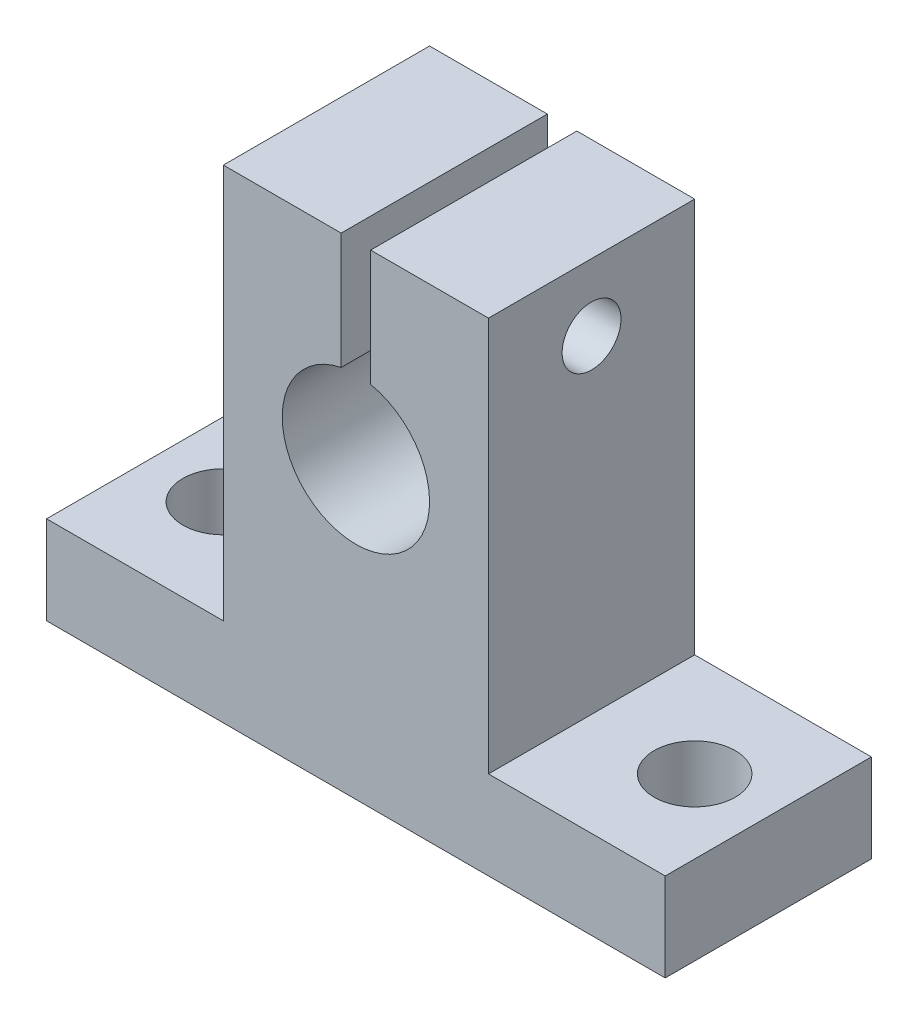
ISO-10303-21;
HEADER;
FILE_DESCRIPTION(('STEP AP214'),'2;1');
FILE_NAME('part.step','',(''),(''),'','','');
FILE_SCHEMA(('AUTOMOTIVE_DESIGN { 1 0 10303 214 1 1 1 1 }'));
ENDSEC;
DATA;
#1=APPLICATION_CONTEXT('core data for automotive mechanical design processes');
#2=APPLICATION_PROTOCOL_DEFINITION('international standard','automotive_design',2000,#1);
#3=PRODUCT_CONTEXT('',#1,'mechanical');
#4=PRODUCT('Part','Part','',(#3));
#5=PRODUCT_RELATED_PRODUCT_CATEGORY('part','',(#4));
#6=PRODUCT_DEFINITION_FORMATION('','',#4);
#7=PRODUCT_DEFINITION_CONTEXT('part definition',#1,'design');
#8=PRODUCT_DEFINITION('design','',#6,#7);
#9=PRODUCT_DEFINITION_SHAPE('','',#8);
#10=(LENGTH_UNIT() NAMED_UNIT(*) SI_UNIT(.MILLI.,.METRE.));
#11=(NAMED_UNIT(*) PLANE_ANGLE_UNIT() SI_UNIT($,.RADIAN.));
#12=(NAMED_UNIT(*) SI_UNIT($,.STERADIAN.) SOLID_ANGLE_UNIT());
#13=UNCERTAINTY_MEASURE_WITH_UNIT(LENGTH_MEASURE(1.E-05),#10,'distance_accuracy_value','');
#14=(GEOMETRIC_REPRESENTATION_CONTEXT(3) GLOBAL_UNCERTAINTY_ASSIGNED_CONTEXT((#13)) GLOBAL_UNIT_ASSIGNED_CONTEXT((#10,
#11,#12)) REPRESENTATION_CONTEXT('',''));
#15=CARTESIAN_POINT('',(0.,0.,0.));
#16=DIRECTION('',(0.,0.,1.));
#17=DIRECTION('',(1.,0.,0.));
#18=AXIS2_PLACEMENT_3D('',#15,#16,#17);
#19=CARTESIAN_POINT('',(42.,28.2542340549186,7.));
#20=DIRECTION('',(-1.,0.,0.));
#21=DIRECTION('',(0.,0.,1.));
#22=AXIS2_PLACEMENT_3D('',#19,#20,#21);
#23=CYLINDRICAL_SURFACE('',#22,2.);
#24=CARTESIAN_POINT('',(20.,28.2542340549186,7.));
#25=DIRECTION('',(-1.,0.,0.));
#26=DIRECTION('',(0.,0.,1.));
#27=AXIS2_PLACEMENT_3D('',#24,#25,#26);
#28=CIRCLE('',#27,2.);
#29=CARTESIAN_POINT('',(20.,28.2542340549186,9.));
#30=VERTEX_POINT('',#29);
#31=EDGE_CURVE('E298',#30,#30,#28,.T.);
#32=ORIENTED_EDGE('',*,*,#31,.F.);
#33=EDGE_LOOP('',(#32));
#34=FACE_BOUND('',#33,.T.);
#35=CARTESIAN_POINT('',(15.,28.2542340549186,7.));
#36=DIRECTION('',(-1.,0.,0.));
#37=DIRECTION('',(0.,0.,1.));
#38=AXIS2_PLACEMENT_3D('',#35,#36,#37);
#39=CIRCLE('',#38,2.);
#40=CARTESIAN_POINT('',(15.,28.2542340549186,9.));
#41=VERTEX_POINT('',#40);
#42=EDGE_CURVE('E38',#41,#41,#39,.F.);
#43=ORIENTED_EDGE('',*,*,#42,.F.);
#44=EDGE_LOOP('',(#43));
#45=FACE_BOUND('',#44,.T.);
#46=ADVANCED_FACE('F34',(#34,#45),#23,.F.);
#47=CARTESIAN_POINT('',(0.,0.,14.));
#48=DIRECTION('',(1.,0.,0.));
#49=DIRECTION('',(0.,0.,-1.));
#50=AXIS2_PLACEMENT_3D('',#47,#48,#49);
#51=PLANE('',#50);
#52=DIRECTION('',(0.,-1.,0.));
#53=VECTOR('',#52,1.);
#54=CARTESIAN_POINT('',(0.,0.,0.));
#55=LINE('',#54,#53);
#56=CARTESIAN_POINT('',(0.,6.,0.));
#57=VERTEX_POINT('',#56);
#58=CARTESIAN_POINT('',(0.,0.,0.));
#59=VERTEX_POINT('',#58);
#60=EDGE_CURVE('E156',#57,#59,#55,.T.);
#61=ORIENTED_EDGE('',*,*,#60,.T.);
#62=DIRECTION('',(0.,0.,-1.));
#63=VECTOR('',#62,1.);
#64=CARTESIAN_POINT('',(0.,0.,14.));
#65=LINE('',#64,#63);
#66=CARTESIAN_POINT('',(0.,0.,14.));
#67=VERTEX_POINT('',#66);
#68=EDGE_CURVE('E11',#67,#59,#65,.T.);
#69=ORIENTED_EDGE('',*,*,#68,.F.);
#70=DIRECTION('',(0.,-1.,0.));
#71=VECTOR('',#70,1.);
#72=CARTESIAN_POINT('',(0.,0.,14.));
#73=LINE('',#72,#71);
#74=CARTESIAN_POINT('',(0.,6.,14.));
#75=VERTEX_POINT('',#74);
#76=EDGE_CURVE('E179',#75,#67,#73,.T.);
#77=ORIENTED_EDGE('',*,*,#76,.F.);
#78=DIRECTION('',(0.,0.,-1.));
#79=VECTOR('',#78,1.);
#80=CARTESIAN_POINT('',(0.,6.,14.));
#81=LINE('',#80,#79);
#82=EDGE_CURVE('E152',#75,#57,#81,.T.);
#83=ORIENTED_EDGE('',*,*,#82,.T.);
#84=EDGE_LOOP('',(#61,#69,#77,#83));
#85=FACE_BOUND('',#84,.T.);
#86=ADVANCED_FACE('F36',(#85),#51,.F.);
#87=CARTESIAN_POINT('',(0.,0.,14.));
#88=DIRECTION('',(0.,1.,0.));
#89=DIRECTION('',(0.,0.,1.));
#90=AXIS2_PLACEMENT_3D('',#87,#88,#89);
#91=PLANE('',#90);
#92=CARTESIAN_POINT('',(37.,0.,7.));
#93=DIRECTION('',(0.,1.,0.));
#94=DIRECTION('',(1.,0.,0.));
#95=AXIS2_PLACEMENT_3D('',#92,#93,#94);
#96=CIRCLE('',#95,2.74999999999999);
#97=CARTESIAN_POINT('',(39.75,0.,7.));
#98=VERTEX_POINT('',#97);
#99=EDGE_CURVE('E296',#98,#98,#96,.T.);
#100=ORIENTED_EDGE('',*,*,#99,.T.);
#101=EDGE_LOOP('',(#100));
#102=FACE_BOUND('',#101,.T.);
#103=CARTESIAN_POINT('',(5.,0.,7.));
#104=DIRECTION('',(0.,1.,0.));
#105=DIRECTION('',(-1.,0.,0.));
#106=AXIS2_PLACEMENT_3D('',#103,#104,#105);
#107=CIRCLE('',#106,2.75);
#108=CARTESIAN_POINT('',(2.25,0.,7.));
#109=VERTEX_POINT('',#108);
#110=EDGE_CURVE('E160',#109,#109,#107,.T.);
#111=ORIENTED_EDGE('',*,*,#110,.T.);
#112=EDGE_LOOP('',(#111));
#113=FACE_BOUND('',#112,.T.);
#114=DIRECTION('',(1.,0.,0.));
#115=VECTOR('',#114,1.);
#116=CARTESIAN_POINT('',(0.,0.,0.));
#117=LINE('',#116,#115);
#118=CARTESIAN_POINT('',(42.,0.,0.));
#119=VERTEX_POINT('',#118);
#120=EDGE_CURVE('E159',#59,#119,#117,.T.);
#121=ORIENTED_EDGE('',*,*,#120,.T.);
#122=DIRECTION('',(0.,0.,-1.));
#123=VECTOR('',#122,1.);
#124=CARTESIAN_POINT('',(42.,0.,14.));
#125=LINE('',#124,#123);
#126=CARTESIAN_POINT('',(42.,0.,14.));
#127=VERTEX_POINT('',#126);
#128=EDGE_CURVE('E44',#127,#119,#125,.T.);
#129=ORIENTED_EDGE('',*,*,#128,.F.);
#130=DIRECTION('',(1.,0.,0.));
#131=VECTOR('',#130,1.);
#132=CARTESIAN_POINT('',(0.,0.,14.));
#133=LINE('',#132,#131);
#134=EDGE_CURVE('E107',#67,#127,#133,.T.);
#135=ORIENTED_EDGE('',*,*,#134,.F.);
#136=ORIENTED_EDGE('',*,*,#68,.T.);
#137=EDGE_LOOP('',(#121,#129,#135,#136));
#138=FACE_BOUND('',#137,.T.);
#139=ADVANCED_FACE('F267',(#102,#113,#138),#91,.F.);
#140=CARTESIAN_POINT('',(42.,0.,14.));
#141=DIRECTION('',(-1.,0.,0.));
#142=DIRECTION('',(0.,0.,1.));
#143=AXIS2_PLACEMENT_3D('',#140,#141,#142);
#144=PLANE('',#143);
#145=DIRECTION('',(0.,1.,0.));
#146=VECTOR('',#145,1.);
#147=CARTESIAN_POINT('',(42.,0.,0.));
#148=LINE('',#147,#146);
#149=CARTESIAN_POINT('',(42.,6.,0.));
#150=VERTEX_POINT('',#149);
#151=EDGE_CURVE('E162',#119,#150,#148,.T.);
#152=ORIENTED_EDGE('',*,*,#151,.T.);
#153=DIRECTION('',(0.,0.,-1.));
#154=VECTOR('',#153,1.);
#155=CARTESIAN_POINT('',(42.,6.,14.));
#156=LINE('',#155,#154);
#157=CARTESIAN_POINT('',(42.,6.,14.));
#158=VERTEX_POINT('',#157);
#159=EDGE_CURVE('E198',#158,#150,#156,.T.);
#160=ORIENTED_EDGE('',*,*,#159,.F.);
#161=DIRECTION('',(0.,1.,0.));
#162=VECTOR('',#161,1.);
#163=CARTESIAN_POINT('',(42.,0.,14.));
#164=LINE('',#163,#162);
#165=EDGE_CURVE('E207',#127,#158,#164,.T.);
#166=ORIENTED_EDGE('',*,*,#165,.F.);
#167=ORIENTED_EDGE('',*,*,#128,.T.);
#168=EDGE_LOOP('',(#152,#160,#166,#167));
#169=FACE_BOUND('',#168,.T.);
#170=ADVANCED_FACE('F205',(#169),#144,.F.);
#171=CARTESIAN_POINT('',(42.,6.,14.));
#172=DIRECTION('',(0.,-1.,0.));
#173=DIRECTION('',(1.,0.,0.));
#174=AXIS2_PLACEMENT_3D('',#171,#172,#173);
#175=PLANE('',#174);
#176=CARTESIAN_POINT('',(37.,5.99999999999999,7.));
#177=DIRECTION('',(0.,1.,0.));
#178=DIRECTION('',(1.,0.,0.));
#179=AXIS2_PLACEMENT_3D('',#176,#177,#178);
#180=CIRCLE('',#179,2.74999999999999);
#181=CARTESIAN_POINT('',(39.75,5.99999999999999,7.));
#182=VERTEX_POINT('',#181);
#183=EDGE_CURVE('E293',#182,#182,#180,.T.);
#184=ORIENTED_EDGE('',*,*,#183,.F.);
#185=EDGE_LOOP('',(#184));
#186=FACE_BOUND('',#185,.T.);
#187=DIRECTION('',(-1.,0.,0.));
#188=VECTOR('',#187,1.);
#189=CARTESIAN_POINT('',(42.,6.,0.));
#190=LINE('',#189,#188);
#191=CARTESIAN_POINT('',(30.,6.,0.));
#192=VERTEX_POINT('',#191);
#193=EDGE_CURVE('E164',#150,#192,#190,.T.);
#194=ORIENTED_EDGE('',*,*,#193,.T.);
#195=DIRECTION('',(0.,0.,-1.));
#196=VECTOR('',#195,1.);
#197=CARTESIAN_POINT('',(30.,6.,14.));
#198=LINE('',#197,#196);
#199=CARTESIAN_POINT('',(30.,6.,14.));
#200=VERTEX_POINT('',#199);
#201=EDGE_CURVE('E195',#200,#192,#198,.T.);
#202=ORIENTED_EDGE('',*,*,#201,.F.);
#203=DIRECTION('',(-1.,0.,0.));
#204=VECTOR('',#203,1.);
#205=CARTESIAN_POINT('',(42.,6.,14.));
#206=LINE('',#205,#204);
#207=EDGE_CURVE('E225',#158,#200,#206,.T.);
#208=ORIENTED_EDGE('',*,*,#207,.F.);
#209=ORIENTED_EDGE('',*,*,#159,.T.);
#210=EDGE_LOOP('',(#194,#202,#208,#209));
#211=FACE_BOUND('',#210,.T.);
#212=ADVANCED_FACE('F216',(#186,#211),#175,.F.);
#213=CARTESIAN_POINT('',(30.,6.,14.));
#214=DIRECTION('',(-1.,0.,0.));
#215=DIRECTION('',(0.,0.,1.));
#216=AXIS2_PLACEMENT_3D('',#213,#214,#215);
#217=PLANE('',#216);
#218=CARTESIAN_POINT('',(30.,28.2542340549186,7.));
#219=DIRECTION('',(-1.,0.,0.));
#220=DIRECTION('',(0.,0.,1.));
#221=AXIS2_PLACEMENT_3D('',#218,#219,#220);
#222=CIRCLE('',#221,2.);
#223=CARTESIAN_POINT('',(30.,28.2542340549186,9.));
#224=VERTEX_POINT('',#223);
#225=EDGE_CURVE('E291',#224,#224,#222,.T.);
#226=ORIENTED_EDGE('',*,*,#225,.T.);
#227=EDGE_LOOP('',(#226));
#228=FACE_BOUND('',#227,.T.);
#229=DIRECTION('',(0.,1.,0.));
#230=VECTOR('',#229,1.);
#231=CARTESIAN_POINT('',(30.,6.,0.));
#232=LINE('',#231,#230);
#233=CARTESIAN_POINT('',(30.,32.8,0.));
#234=VERTEX_POINT('',#233);
#235=EDGE_CURVE('E166',#192,#234,#232,.T.);
#236=ORIENTED_EDGE('',*,*,#235,.T.);
#237=DIRECTION('',(0.,0.,-1.));
#238=VECTOR('',#237,1.);
#239=CARTESIAN_POINT('',(30.,32.8,14.));
#240=LINE('',#239,#238);
#241=CARTESIAN_POINT('',(30.,32.8,14.));
#242=VERTEX_POINT('',#241);
#243=EDGE_CURVE('E192',#242,#234,#240,.T.);
#244=ORIENTED_EDGE('',*,*,#243,.F.);
#245=DIRECTION('',(0.,1.,0.));
#246=VECTOR('',#245,1.);
#247=CARTESIAN_POINT('',(30.,6.,14.));
#248=LINE('',#247,#246);
#249=EDGE_CURVE('E222',#200,#242,#248,.T.);
#250=ORIENTED_EDGE('',*,*,#249,.F.);
#251=ORIENTED_EDGE('',*,*,#201,.T.);
#252=EDGE_LOOP('',(#236,#244,#250,#251));
#253=FACE_BOUND('',#252,.T.);
#254=ADVANCED_FACE('F220',(#228,#253),#217,.F.);
#255=CARTESIAN_POINT('',(30.,32.8,14.));
#256=DIRECTION('',(0.,-1.,0.));
#257=DIRECTION('',(0.,0.,-1.));
#258=AXIS2_PLACEMENT_3D('',#255,#256,#257);
#259=PLANE('',#258);
#260=DIRECTION('',(-1.,0.,0.));
#261=VECTOR('',#260,1.);
#262=CARTESIAN_POINT('',(30.,32.8,0.));
#263=LINE('',#262,#261);
#264=CARTESIAN_POINT('',(22.,32.8,0.));
#265=VERTEX_POINT('',#264);
#266=EDGE_CURVE('E168',#234,#265,#263,.T.);
#267=ORIENTED_EDGE('',*,*,#266,.T.);
#268=DIRECTION('',(0.,0.,-1.));
#269=VECTOR('',#268,1.);
#270=CARTESIAN_POINT('',(22.,32.8,14.));
#271=LINE('',#270,#269);
#272=CARTESIAN_POINT('',(22.,32.8,14.));
#273=VERTEX_POINT('',#272);
#274=EDGE_CURVE('E189',#273,#265,#271,.T.);
#275=ORIENTED_EDGE('',*,*,#274,.F.);
#276=DIRECTION('',(-1.,0.,0.));
#277=VECTOR('',#276,1.);
#278=CARTESIAN_POINT('',(30.,32.8,14.));
#279=LINE('',#278,#277);
#280=EDGE_CURVE('E224',#242,#273,#279,.T.);
#281=ORIENTED_EDGE('',*,*,#280,.F.);
#282=ORIENTED_EDGE('',*,*,#243,.T.);
#283=EDGE_LOOP('',(#267,#275,#281,#282));
#284=FACE_BOUND('',#283,.T.);
#285=ADVANCED_FACE('F331',(#284),#259,.F.);
#286=CARTESIAN_POINT('',(22.,32.8,14.));
#287=DIRECTION('',(1.,0.,0.));
#288=DIRECTION('',(0.,0.,-1.));
#289=AXIS2_PLACEMENT_3D('',#286,#287,#288);
#290=PLANE('',#289);
#291=CARTESIAN_POINT('',(22.,28.2542340549186,7.));
#292=DIRECTION('',(1.,0.,0.));
#293=DIRECTION('',(0.,0.,-1.));
#294=AXIS2_PLACEMENT_3D('',#291,#292,#293);
#295=CIRCLE('',#294,2.);
#296=CARTESIAN_POINT('',(22.,28.2542340549186,5.));
#297=VERTEX_POINT('',#296);
#298=EDGE_CURVE('E288',#297,#297,#295,.T.);
#299=ORIENTED_EDGE('',*,*,#298,.T.);
#300=EDGE_LOOP('',(#299));
#301=FACE_BOUND('',#300,.T.);
#302=DIRECTION('',(0.,-1.,0.));
#303=VECTOR('',#302,1.);
#304=CARTESIAN_POINT('',(22.,32.8,0.));
#305=LINE('',#304,#303);
#306=CARTESIAN_POINT('',(22.,24.8989794855664,0.));
#307=VERTEX_POINT('',#306);
#308=EDGE_CURVE('E170',#265,#307,#305,.T.);
#309=ORIENTED_EDGE('',*,*,#308,.T.);
#310=DIRECTION('',(0.,0.,-1.));
#311=VECTOR('',#310,1.);
#312=CARTESIAN_POINT('',(22.,24.8989794855664,14.));
#313=LINE('',#312,#311);
#314=CARTESIAN_POINT('',(22.,24.8989794855664,14.));
#315=VERTEX_POINT('',#314);
#316=EDGE_CURVE('E186',#315,#307,#313,.T.);
#317=ORIENTED_EDGE('',*,*,#316,.F.);
#318=DIRECTION('',(0.,-1.,0.));
#319=VECTOR('',#318,1.);
#320=CARTESIAN_POINT('',(22.,32.8,14.));
#321=LINE('',#320,#319);
#322=EDGE_CURVE('E227',#273,#315,#321,.T.);
#323=ORIENTED_EDGE('',*,*,#322,.F.);
#324=ORIENTED_EDGE('',*,*,#274,.T.);
#325=EDGE_LOOP('',(#309,#317,#323,#324));
#326=FACE_BOUND('',#325,.T.);
#327=ADVANCED_FACE('F334',(#301,#326),#290,.F.);
#328=CARTESIAN_POINT('',(21.,20.,14.));
#329=DIRECTION('',(0.,0.,-1.));
#330=DIRECTION('',(-1.,0.,0.));
#331=AXIS2_PLACEMENT_3D('',#328,#329,#330);
#332=CYLINDRICAL_SURFACE('',#331,5.);
#333=CARTESIAN_POINT('',(21.,20.,0.));
#334=DIRECTION('',(0.,0.,-1.));
#335=DIRECTION('',(1.,0.,0.));
#336=AXIS2_PLACEMENT_3D('',#333,#334,#335);
#337=CIRCLE('',#336,5.);
#338=CARTESIAN_POINT('',(20.,24.8989794855664,0.));
#339=VERTEX_POINT('',#338);
#340=EDGE_CURVE('E172',#307,#339,#337,.T.);
#341=ORIENTED_EDGE('',*,*,#340,.T.);
#342=DIRECTION('',(0.,0.,-1.));
#343=VECTOR('',#342,1.);
#344=CARTESIAN_POINT('',(20.,24.8989794855664,14.));
#345=LINE('',#344,#343);
#346=CARTESIAN_POINT('',(20.,24.8989794855664,14.));
#347=VERTEX_POINT('',#346);
#348=EDGE_CURVE('E183',#347,#339,#345,.T.);
#349=ORIENTED_EDGE('',*,*,#348,.F.);
#350=CARTESIAN_POINT('',(21.,20.,14.));
#351=DIRECTION('',(0.,0.,-1.));
#352=DIRECTION('',(1.,0.,0.));
#353=AXIS2_PLACEMENT_3D('',#350,#351,#352);
#354=CIRCLE('',#353,5.);
#355=EDGE_CURVE('E233',#315,#347,#354,.T.);
#356=ORIENTED_EDGE('',*,*,#355,.F.);
#357=ORIENTED_EDGE('',*,*,#316,.T.);
#358=EDGE_LOOP('',(#341,#349,#356,#357));
#359=FACE_BOUND('',#358,.T.);
#360=ADVANCED_FACE('F239',(#359),#332,.F.);
#361=CARTESIAN_POINT('',(20.,32.8,14.));
#362=DIRECTION('',(-1.,0.,0.));
#363=DIRECTION('',(0.,0.,1.));
#364=AXIS2_PLACEMENT_3D('',#361,#362,#363);
#365=PLANE('',#364);
#366=ORIENTED_EDGE('',*,*,#31,.T.);
#367=EDGE_LOOP('',(#366));
#368=FACE_BOUND('',#367,.T.);
#369=DIRECTION('',(0.,1.,0.));
#370=VECTOR('',#369,1.);
#371=CARTESIAN_POINT('',(20.,32.8,0.));
#372=LINE('',#371,#370);
#373=CARTESIAN_POINT('',(20.,32.8,0.));
#374=VERTEX_POINT('',#373);
#375=EDGE_CURVE('E174',#339,#374,#372,.T.);
#376=ORIENTED_EDGE('',*,*,#375,.T.);
#377=DIRECTION('',(0.,0.,-1.));
#378=VECTOR('',#377,1.);
#379=CARTESIAN_POINT('',(20.,32.8,14.));
#380=LINE('',#379,#378);
#381=CARTESIAN_POINT('',(20.,32.8,14.));
#382=VERTEX_POINT('',#381);
#383=EDGE_CURVE('E147',#382,#374,#380,.T.);
#384=ORIENTED_EDGE('',*,*,#383,.F.);
#385=DIRECTION('',(0.,1.,0.));
#386=VECTOR('',#385,1.);
#387=CARTESIAN_POINT('',(20.,32.8,14.));
#388=LINE('',#387,#386);
#389=EDGE_CURVE('E138',#347,#382,#388,.T.);
#390=ORIENTED_EDGE('',*,*,#389,.F.);
#391=ORIENTED_EDGE('',*,*,#348,.T.);
#392=EDGE_LOOP('',(#376,#384,#390,#391));
#393=FACE_BOUND('',#392,.T.);
#394=ADVANCED_FACE('F243',(#368,#393),#365,.F.);
#395=CARTESIAN_POINT('',(12.,32.8,14.));
#396=DIRECTION('',(0.,-1.,0.));
#397=DIRECTION('',(0.,0.,-1.));
#398=AXIS2_PLACEMENT_3D('',#395,#396,#397);
#399=PLANE('',#398);
#400=DIRECTION('',(-1.,0.,0.));
#401=VECTOR('',#400,1.);
#402=CARTESIAN_POINT('',(12.,32.8,0.));
#403=LINE('',#402,#401);
#404=CARTESIAN_POINT('',(12.,32.8,0.));
#405=VERTEX_POINT('',#404);
#406=EDGE_CURVE('E146',#374,#405,#403,.T.);
#407=ORIENTED_EDGE('',*,*,#406,.T.);
#408=DIRECTION('',(0.,0.,-1.));
#409=VECTOR('',#408,1.);
#410=CARTESIAN_POINT('',(12.,32.8,14.));
#411=LINE('',#410,#409);
#412=CARTESIAN_POINT('',(12.,32.8,14.));
#413=VERTEX_POINT('',#412);
#414=EDGE_CURVE('E143',#413,#405,#411,.T.);
#415=ORIENTED_EDGE('',*,*,#414,.F.);
#416=DIRECTION('',(-1.,0.,0.));
#417=VECTOR('',#416,1.);
#418=CARTESIAN_POINT('',(12.,32.8,14.));
#419=LINE('',#418,#417);
#420=EDGE_CURVE('E132',#382,#413,#419,.T.);
#421=ORIENTED_EDGE('',*,*,#420,.F.);
#422=ORIENTED_EDGE('',*,*,#383,.T.);
#423=EDGE_LOOP('',(#407,#415,#421,#422));
#424=FACE_BOUND('',#423,.T.);
#425=ADVANCED_FACE('F144',(#424),#399,.F.);
#426=CARTESIAN_POINT('',(12.,6.,14.));
#427=DIRECTION('',(1.,0.,0.));
#428=DIRECTION('',(0.,0.,-1.));
#429=AXIS2_PLACEMENT_3D('',#426,#427,#428);
#430=PLANE('',#429);
#431=CARTESIAN_POINT('',(12.,28.2542340549186,7.));
#432=DIRECTION('',(-1.,0.,0.));
#433=DIRECTION('',(0.,0.,1.));
#434=AXIS2_PLACEMENT_3D('',#431,#432,#433);
#435=CIRCLE('',#434,3.5);
#436=CARTESIAN_POINT('',(12.,28.2542340549186,10.5));
#437=VERTEX_POINT('',#436);
#438=EDGE_CURVE('E382',#437,#437,#435,.T.);
#439=ORIENTED_EDGE('',*,*,#438,.F.);
#440=EDGE_LOOP('',(#439));
#441=FACE_BOUND('',#440,.T.);
#442=DIRECTION('',(0.,-1.,0.));
#443=VECTOR('',#442,1.);
#444=CARTESIAN_POINT('',(12.,6.,0.));
#445=LINE('',#444,#443);
#446=CARTESIAN_POINT('',(12.,6.,0.));
#447=VERTEX_POINT('',#446);
#448=EDGE_CURVE('E93',#405,#447,#445,.T.);
#449=ORIENTED_EDGE('',*,*,#448,.T.);
#450=DIRECTION('',(0.,0.,-1.));
#451=VECTOR('',#450,1.);
#452=CARTESIAN_POINT('',(12.,6.,14.));
#453=LINE('',#452,#451);
#454=CARTESIAN_POINT('',(12.,6.,14.));
#455=VERTEX_POINT('',#454);
#456=EDGE_CURVE('E148',#455,#447,#453,.T.);
#457=ORIENTED_EDGE('',*,*,#456,.F.);
#458=DIRECTION('',(0.,-1.,0.));
#459=VECTOR('',#458,1.);
#460=CARTESIAN_POINT('',(12.,6.,14.));
#461=LINE('',#460,#459);
#462=EDGE_CURVE('E136',#413,#455,#461,.T.);
#463=ORIENTED_EDGE('',*,*,#462,.F.);
#464=ORIENTED_EDGE('',*,*,#414,.T.);
#465=EDGE_LOOP('',(#449,#457,#463,#464));
#466=FACE_BOUND('',#465,.T.);
#467=ADVANCED_FACE('F150',(#441,#466),#430,.F.);
#468=CARTESIAN_POINT('',(0.,6.,14.));
#469=DIRECTION('',(0.,-1.,0.));
#470=DIRECTION('',(1.,0.,0.));
#471=AXIS2_PLACEMENT_3D('',#468,#469,#470);
#472=PLANE('',#471);
#473=CARTESIAN_POINT('',(5.,6.,7.));
#474=DIRECTION('',(0.,1.,0.));
#475=DIRECTION('',(-1.,0.,0.));
#476=AXIS2_PLACEMENT_3D('',#473,#474,#475);
#477=CIRCLE('',#476,2.75);
#478=CARTESIAN_POINT('',(2.25,6.,7.));
#479=VERTEX_POINT('',#478);
#480=EDGE_CURVE('E303',#479,#479,#477,.T.);
#481=ORIENTED_EDGE('',*,*,#480,.F.);
#482=EDGE_LOOP('',(#481));
#483=FACE_BOUND('',#482,.T.);
#484=DIRECTION('',(-1.,0.,0.));
#485=VECTOR('',#484,1.);
#486=CARTESIAN_POINT('',(0.,6.,0.));
#487=LINE('',#486,#485);
#488=EDGE_CURVE('E99',#447,#57,#487,.T.);
#489=ORIENTED_EDGE('',*,*,#488,.T.);
#490=ORIENTED_EDGE('',*,*,#82,.F.);
#491=DIRECTION('',(-1.,0.,0.));
#492=VECTOR('',#491,1.);
#493=CARTESIAN_POINT('',(0.,6.,14.));
#494=LINE('',#493,#492);
#495=EDGE_CURVE('E52',#455,#75,#494,.T.);
#496=ORIENTED_EDGE('',*,*,#495,.F.);
#497=ORIENTED_EDGE('',*,*,#456,.T.);
#498=EDGE_LOOP('',(#489,#490,#496,#497));
#499=FACE_BOUND('',#498,.T.);
#500=ADVANCED_FACE('F247',(#483,#499),#472,.F.);
#501=CARTESIAN_POINT('',(21.,20.,14.));
#502=DIRECTION('',(0.,0.,1.));
#503=DIRECTION('',(1.,0.,0.));
#504=AXIS2_PLACEMENT_3D('',#501,#502,#503);
#505=PLANE('',#504);
#506=ORIENTED_EDGE('',*,*,#76,.T.);
#507=ORIENTED_EDGE('',*,*,#134,.T.);
#508=ORIENTED_EDGE('',*,*,#165,.T.);
#509=ORIENTED_EDGE('',*,*,#207,.T.);
#510=ORIENTED_EDGE('',*,*,#249,.T.);
#511=ORIENTED_EDGE('',*,*,#280,.T.);
#512=ORIENTED_EDGE('',*,*,#322,.T.);
#513=ORIENTED_EDGE('',*,*,#355,.T.);
#514=ORIENTED_EDGE('',*,*,#389,.T.);
#515=ORIENTED_EDGE('',*,*,#420,.T.);
#516=ORIENTED_EDGE('',*,*,#462,.T.);
#517=ORIENTED_EDGE('',*,*,#495,.T.);
#518=EDGE_LOOP('',(#506,#507,#508,#509,#510,#511,#512,#513,#514,#515,#516,#517));
#519=FACE_BOUND('',#518,.T.);
#520=ADVANCED_FACE('F134',(#519),#505,.T.);
#521=CARTESIAN_POINT('',(21.,20.,0.));
#522=DIRECTION('',(0.,0.,1.));
#523=DIRECTION('',(1.,0.,0.));
#524=AXIS2_PLACEMENT_3D('',#521,#522,#523);
#525=PLANE('',#524);
#526=ORIENTED_EDGE('',*,*,#60,.F.);
#527=ORIENTED_EDGE('',*,*,#488,.F.);
#528=ORIENTED_EDGE('',*,*,#448,.F.);
#529=ORIENTED_EDGE('',*,*,#406,.F.);
#530=ORIENTED_EDGE('',*,*,#375,.F.);
#531=ORIENTED_EDGE('',*,*,#340,.F.);
#532=ORIENTED_EDGE('',*,*,#308,.F.);
#533=ORIENTED_EDGE('',*,*,#266,.F.);
#534=ORIENTED_EDGE('',*,*,#235,.F.);
#535=ORIENTED_EDGE('',*,*,#193,.F.);
#536=ORIENTED_EDGE('',*,*,#151,.F.);
#537=ORIENTED_EDGE('',*,*,#120,.F.);
#538=EDGE_LOOP('',(#526,#527,#528,#529,#530,#531,#532,#533,#534,#535,#536,#537));
#539=FACE_BOUND('',#538,.T.);
#540=ADVANCED_FACE('F211',(#539),#525,.F.);
#541=CARTESIAN_POINT('',(5.,0.,7.));
#542=DIRECTION('',(0.,1.,0.));
#543=DIRECTION('',(-1.,0.,0.));
#544=AXIS2_PLACEMENT_3D('',#541,#542,#543);
#545=CYLINDRICAL_SURFACE('',#544,2.75);
#546=ORIENTED_EDGE('',*,*,#110,.F.);
#547=EDGE_LOOP('',(#546));
#548=FACE_BOUND('',#547,.T.);
#549=ORIENTED_EDGE('',*,*,#480,.T.);
#550=EDGE_LOOP('',(#549));
#551=FACE_BOUND('',#550,.T.);
#552=ADVANCED_FACE('F283',(#548,#551),#545,.F.);
#553=CARTESIAN_POINT('',(37.,0.,7.));
#554=DIRECTION('',(0.,1.,0.));
#555=DIRECTION('',(-1.,0.,0.));
#556=AXIS2_PLACEMENT_3D('',#553,#554,#555);
#557=CYLINDRICAL_SURFACE('',#556,2.74999999999999);
#558=ORIENTED_EDGE('',*,*,#99,.F.);
#559=EDGE_LOOP('',(#558));
#560=FACE_BOUND('',#559,.T.);
#561=ORIENTED_EDGE('',*,*,#183,.T.);
#562=EDGE_LOOP('',(#561));
#563=FACE_BOUND('',#562,.T.);
#564=ADVANCED_FACE('F274',(#560,#563),#557,.F.);
#565=ORIENTED_EDGE('',*,*,#298,.F.);
#566=EDGE_LOOP('',(#565));
#567=FACE_BOUND('',#566,.T.);
#568=ORIENTED_EDGE('',*,*,#225,.F.);
#569=EDGE_LOOP('',(#568));
#570=FACE_BOUND('',#569,.T.);
#571=ADVANCED_FACE('F263',(#567,#570),#23,.F.);
#572=CARTESIAN_POINT('',(15.,28.2542340549186,7.));
#573=DIRECTION('',(-1.,0.,0.));
#574=DIRECTION('',(0.,0.,1.));
#575=AXIS2_PLACEMENT_3D('',#572,#573,#574);
#576=PLANE('',#575);
#577=CARTESIAN_POINT('',(15.,28.2542340549186,7.));
#578=DIRECTION('',(-1.,0.,0.));
#579=DIRECTION('',(0.,0.,1.));
#580=AXIS2_PLACEMENT_3D('',#577,#578,#579);
#581=CIRCLE('',#580,3.5);
#582=CARTESIAN_POINT('',(15.,28.2542340549186,10.5));
#583=VERTEX_POINT('',#582);
#584=EDGE_CURVE('E379',#583,#583,#581,.T.);
#585=ORIENTED_EDGE('',*,*,#584,.T.);
#586=EDGE_LOOP('',(#585));
#587=FACE_BOUND('',#586,.T.);
#588=ORIENTED_EDGE('',*,*,#42,.T.);
#589=EDGE_LOOP('',(#588));
#590=FACE_BOUND('',#589,.T.);
#591=ADVANCED_FACE('F273',(#587,#590),#576,.T.);
#592=CARTESIAN_POINT('',(15.,28.2542340549186,7.));
#593=DIRECTION('',(-1.,0.,0.));
#594=DIRECTION('',(0.,0.,1.));
#595=AXIS2_PLACEMENT_3D('',#592,#593,#594);
#596=CYLINDRICAL_SURFACE('',#595,3.5);
#597=ORIENTED_EDGE('',*,*,#584,.F.);
#598=EDGE_LOOP('',(#597));
#599=FACE_BOUND('',#598,.T.);
#600=ORIENTED_EDGE('',*,*,#438,.T.);
#601=EDGE_LOOP('',(#600));
#602=FACE_BOUND('',#601,.T.);
#603=ADVANCED_FACE('F280',(#599,#602),#596,.F.);
#604=CLOSED_SHELL('',(#46,#86,#139,#170,#212,#254,#285,#327,#360,#394,#425,#467,#500,#520,#540,
#552,#564,#571,#591,#603));
#605=MANIFOLD_SOLID_BREP('B2',#604);
#606=ADVANCED_BREP_SHAPE_REPRESENTATION('',(#18,#605),#14);
#607=SHAPE_DEFINITION_REPRESENTATION(#9,#606);
ENDSEC;
END-ISO-10303-21;
